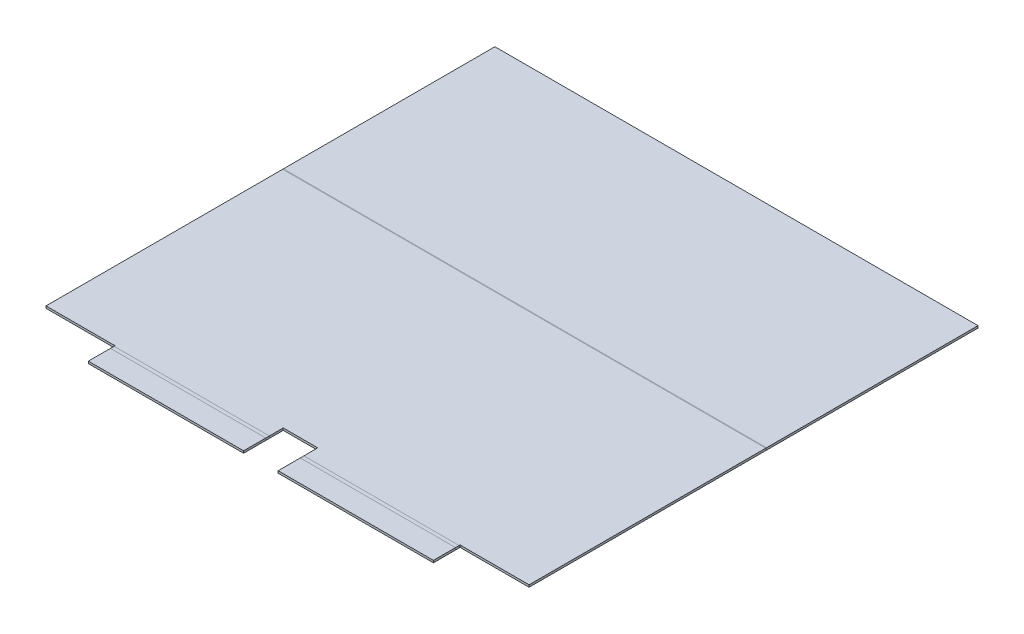
ISO-10303-21;
HEADER;
FILE_DESCRIPTION(('STEP AP214'),'2;1');
FILE_NAME('part.step','',(''),(''),'','','');
FILE_SCHEMA(('AUTOMOTIVE_DESIGN { 1 0 10303 214 1 1 1 1 }'));
ENDSEC;
DATA;
#1=APPLICATION_CONTEXT('core data for automotive mechanical design processes');
#2=APPLICATION_PROTOCOL_DEFINITION('international standard','automotive_design',2000,#1);
#3=PRODUCT_CONTEXT('',#1,'mechanical');
#4=PRODUCT('Part','Part','',(#3));
#5=PRODUCT_RELATED_PRODUCT_CATEGORY('part','',(#4));
#6=PRODUCT_DEFINITION_FORMATION('','',#4);
#7=PRODUCT_DEFINITION_CONTEXT('part definition',#1,'design');
#8=PRODUCT_DEFINITION('design','',#6,#7);
#9=PRODUCT_DEFINITION_SHAPE('','',#8);
#10=(LENGTH_UNIT() NAMED_UNIT(*) SI_UNIT(.MILLI.,.METRE.));
#11=(NAMED_UNIT(*) PLANE_ANGLE_UNIT() SI_UNIT($,.RADIAN.));
#12=(NAMED_UNIT(*) SI_UNIT($,.STERADIAN.) SOLID_ANGLE_UNIT());
#13=UNCERTAINTY_MEASURE_WITH_UNIT(LENGTH_MEASURE(1.E-05),#10,'distance_accuracy_value','');
#14=(GEOMETRIC_REPRESENTATION_CONTEXT(3) GLOBAL_UNCERTAINTY_ASSIGNED_CONTEXT((#13)) GLOBAL_UNIT_ASSIGNED_CONTEXT((#10,
#11,#12)) REPRESENTATION_CONTEXT('',''));
#15=CARTESIAN_POINT('',(0.,0.,0.));
#16=DIRECTION('',(0.,0.,1.));
#17=DIRECTION('',(1.,0.,0.));
#18=AXIS2_PLACEMENT_3D('',#15,#16,#17);
#19=CARTESIAN_POINT('',(0.,1.58749999999895,5.31041367340421));
#20=DIRECTION('',(0.,1.,0.));
#21=DIRECTION('',(0.,0.,1.));
#22=AXIS2_PLACEMENT_3D('',#19,#20,#21);
#23=PLANE('',#22);
#24=DIRECTION('',(0.,0.,-1.));
#25=VECTOR('',#24,1.);
#26=CARTESIAN_POINT('',(190.5,1.58750000000119,333.622969449045));
#27=LINE('',#26,#25);
#28=CARTESIAN_POINT('',(190.5,1.58750000000119,331.133134006371));
#29=VERTEX_POINT('',#28);
#30=CARTESIAN_POINT('',(190.5,1.58750000000112,320.922969449045));
#31=VERTEX_POINT('',#30);
#32=EDGE_CURVE('E458',#29,#31,#27,.T.);
#33=ORIENTED_EDGE('',*,*,#32,.F.);
#34=DIRECTION('',(1.,0.,0.));
#35=VECTOR('',#34,1.);
#36=CARTESIAN_POINT('',(190.5,1.58750000000119,331.133134006371));
#37=LINE('',#36,#35);
#38=CARTESIAN_POINT('',(304.8,1.58750000000119,331.133134006371));
#39=VERTEX_POINT('',#38);
#40=EDGE_CURVE('E533',#29,#39,#37,.T.);
#41=ORIENTED_EDGE('',*,*,#40,.T.);
#42=DIRECTION('',(0.,0.,1.));
#43=VECTOR('',#42,1.);
#44=CARTESIAN_POINT('',(304.8,1.58750000000123,333.622969449045));
#45=LINE('',#44,#43);
#46=CARTESIAN_POINT('',(304.8,1.58750000000119,330.339384006371));
#47=VERTEX_POINT('',#46);
#48=EDGE_CURVE('E485',#47,#39,#45,.T.);
#49=ORIENTED_EDGE('',*,*,#48,.F.);
#50=DIRECTION('',(1.,0.,0.));
#51=VECTOR('',#50,1.);
#52=CARTESIAN_POINT('',(0.,1.58750000000121,330.339384006371));
#53=LINE('',#52,#51);
#54=CARTESIAN_POINT('',(305.59375,1.58750000000119,330.339384006371));
#55=VERTEX_POINT('',#54);
#56=EDGE_CURVE('E435',#47,#55,#53,.T.);
#57=ORIENTED_EDGE('',*,*,#56,.T.);
#58=DIRECTION('',(0.,0.,1.));
#59=VECTOR('',#58,1.);
#60=CARTESIAN_POINT('',(305.59375,1.58749999999895,5.31041367340421));
#61=LINE('',#60,#59);
#62=CARTESIAN_POINT('',(305.59375,1.58750000000121,330.447969449045));
#63=VERTEX_POINT('',#62);
#64=EDGE_CURVE('E425',#55,#63,#61,.T.);
#65=ORIENTED_EDGE('',*,*,#64,.T.);
#66=DIRECTION('',(-1.,0.,0.));
#67=VECTOR('',#66,1.);
#68=CARTESIAN_POINT('',(355.6,1.58750000000121,330.447969449045));
#69=LINE('',#68,#67);
#70=CARTESIAN_POINT('',(355.6,1.58750000000121,330.447969449045));
#71=VERTEX_POINT('',#70);
#72=EDGE_CURVE('E473',#71,#63,#69,.T.);
#73=ORIENTED_EDGE('',*,*,#72,.F.);
#74=DIRECTION('',(0.,0.,1.));
#75=VECTOR('',#74,1.);
#76=CARTESIAN_POINT('',(355.6,1.58750000000121,333.622969449044));
#77=LINE('',#76,#75);
#78=CARTESIAN_POINT('',(355.6,1.58749999999999,156.232770984909));
#79=VERTEX_POINT('',#78);
#80=EDGE_CURVE('E497',#79,#71,#77,.T.);
#81=ORIENTED_EDGE('',*,*,#80,.F.);
#82=DIRECTION('',(-1.,0.,0.));
#83=VECTOR('',#82,1.);
#84=CARTESIAN_POINT('',(0.,1.58749999999998,156.232770984909));
#85=LINE('',#84,#83);
#86=CARTESIAN_POINT('',(0.,1.58749999999998,156.232770984909));
#87=VERTEX_POINT('',#86);
#88=EDGE_CURVE('E523',#79,#87,#85,.T.);
#89=ORIENTED_EDGE('',*,*,#88,.T.);
#90=DIRECTION('',(0.,0.,-1.));
#91=VECTOR('',#90,1.);
#92=CARTESIAN_POINT('',(0.,1.58749999999999,156.102888530919));
#93=LINE('',#92,#91);
#94=CARTESIAN_POINT('',(0.,1.58750000000121,330.447969449045));
#95=VERTEX_POINT('',#94);
#96=EDGE_CURVE('E494',#95,#87,#93,.T.);
#97=ORIENTED_EDGE('',*,*,#96,.F.);
#98=DIRECTION('',(-1.,0.,0.));
#99=VECTOR('',#98,1.);
#100=CARTESIAN_POINT('',(0.,1.58750000000121,330.447969449045));
#101=LINE('',#100,#99);
#102=CARTESIAN_POINT('',(50.00625,1.58750000000121,330.447969449045));
#103=VERTEX_POINT('',#102);
#104=EDGE_CURVE('E476',#103,#95,#101,.T.);
#105=ORIENTED_EDGE('',*,*,#104,.F.);
#106=DIRECTION('',(0.,0.,-1.));
#107=VECTOR('',#106,1.);
#108=CARTESIAN_POINT('',(50.00625,1.58749999999895,5.31041367340421));
#109=LINE('',#108,#107);
#110=CARTESIAN_POINT('',(50.00625,1.58750000000119,330.339384006371));
#111=VERTEX_POINT('',#110);
#112=EDGE_CURVE('E442',#103,#111,#109,.T.);
#113=ORIENTED_EDGE('',*,*,#112,.T.);
#114=DIRECTION('',(1.,0.,0.));
#115=VECTOR('',#114,1.);
#116=CARTESIAN_POINT('',(0.,1.58750000000119,330.339384006371));
#117=LINE('',#116,#115);
#118=CARTESIAN_POINT('',(50.8,1.58750000000119,330.339384006371));
#119=VERTEX_POINT('',#118);
#120=EDGE_CURVE('E452',#111,#119,#117,.T.);
#121=ORIENTED_EDGE('',*,*,#120,.T.);
#122=DIRECTION('',(0.,0.,-1.));
#123=VECTOR('',#122,1.);
#124=CARTESIAN_POINT('',(50.8,1.58750000000123,333.622969449045));
#125=LINE('',#124,#123);
#126=CARTESIAN_POINT('',(50.8,1.58750000000122,331.133134006371));
#127=VERTEX_POINT('',#126);
#128=EDGE_CURVE('E474',#127,#119,#125,.T.);
#129=ORIENTED_EDGE('',*,*,#128,.F.);
#130=DIRECTION('',(1.,0.,0.));
#131=VECTOR('',#130,1.);
#132=CARTESIAN_POINT('',(50.8,1.58750000000122,331.133134006371));
#133=LINE('',#132,#131);
#134=CARTESIAN_POINT('',(165.1,1.58750000000123,331.133134006371));
#135=VERTEX_POINT('',#134);
#136=EDGE_CURVE('E107',#127,#135,#133,.T.);
#137=ORIENTED_EDGE('',*,*,#136,.T.);
#138=DIRECTION('',(0.,0.,1.));
#139=VECTOR('',#138,1.);
#140=CARTESIAN_POINT('',(165.1,1.58750000000119,333.622969449045));
#141=LINE('',#140,#139);
#142=CARTESIAN_POINT('',(165.1,1.58750000000112,320.922969449045));
#143=VERTEX_POINT('',#142);
#144=EDGE_CURVE('E455',#143,#135,#141,.T.);
#145=ORIENTED_EDGE('',*,*,#144,.F.);
#146=DIRECTION('',(-1.,0.,0.));
#147=VECTOR('',#146,1.);
#148=CARTESIAN_POINT('',(165.1,1.58750000000112,320.922969449045));
#149=LINE('',#148,#147);
#150=EDGE_CURVE('E460',#31,#143,#149,.T.);
#151=ORIENTED_EDGE('',*,*,#150,.F.);
#152=EDGE_LOOP('',(#33,#41,#49,#57,#65,#73,#81,#89,#97,#105,#113,#121,#129,#137,#145,#151));
#153=FACE_BOUND('',#152,.T.);
#154=ADVANCED_FACE('F99',(#153),#23,.T.);
#155=CARTESIAN_POINT('',(0.,-1.0547118733939E-12,5.31041367340422));
#156=DIRECTION('',(0.,1.,0.));
#157=DIRECTION('',(0.,0.,1.));
#158=AXIS2_PLACEMENT_3D('',#155,#156,#157);
#159=PLANE('',#158);
#160=DIRECTION('',(1.,0.,0.));
#161=VECTOR('',#160,1.);
#162=CARTESIAN_POINT('',(190.5,1.19348975147204E-12,331.133134006371));
#163=LINE('',#162,#161);
#164=CARTESIAN_POINT('',(190.5,1.19399607209385E-12,331.133134006371));
#165=VERTEX_POINT('',#164);
#166=CARTESIAN_POINT('',(304.8,1.19348975147204E-12,331.133134006371));
#167=VERTEX_POINT('',#166);
#168=EDGE_CURVE('E529',#165,#167,#163,.T.);
#169=ORIENTED_EDGE('',*,*,#168,.F.);
#170=DIRECTION('',(0.,0.,-1.));
#171=VECTOR('',#170,1.);
#172=CARTESIAN_POINT('',(190.500000000001,-1.0547118733939E-12,5.31041367340464));
#173=LINE('',#172,#171);
#174=CARTESIAN_POINT('',(190.5,1.13103970633688E-12,320.922969449045));
#175=VERTEX_POINT('',#174);
#176=EDGE_CURVE('E466',#165,#175,#173,.T.);
#177=ORIENTED_EDGE('',*,*,#176,.T.);
#178=DIRECTION('',(-1.,0.,0.));
#179=VECTOR('',#178,1.);
#180=CARTESIAN_POINT('',(0.,1.13103970633688E-12,320.922969449045));
#181=LINE('',#180,#179);
#182=CARTESIAN_POINT('',(165.1,1.13103970633688E-12,320.922969449045));
#183=VERTEX_POINT('',#182);
#184=EDGE_CURVE('E509',#175,#183,#181,.T.);
#185=ORIENTED_EDGE('',*,*,#184,.T.);
#186=DIRECTION('',(0.,0.,1.));
#187=VECTOR('',#186,1.);
#188=CARTESIAN_POINT('',(165.1,-1.0547118733939E-12,5.31041367340422));
#189=LINE('',#188,#187);
#190=CARTESIAN_POINT('',(165.1,1.22818422099158E-12,331.133134006371));
#191=VERTEX_POINT('',#190);
#192=EDGE_CURVE('E470',#183,#191,#189,.T.);
#193=ORIENTED_EDGE('',*,*,#192,.T.);
#194=DIRECTION('',(1.,0.,0.));
#195=VECTOR('',#194,1.);
#196=CARTESIAN_POINT('',(50.8,1.22818422099158E-12,331.133134006371));
#197=LINE('',#196,#195);
#198=CARTESIAN_POINT('',(50.8,1.22869054161338E-12,331.133134006371));
#199=VERTEX_POINT('',#198);
#200=EDGE_CURVE('E539',#199,#191,#197,.T.);
#201=ORIENTED_EDGE('',*,*,#200,.F.);
#202=DIRECTION('',(0.,0.,-1.));
#203=VECTOR('',#202,1.);
#204=CARTESIAN_POINT('',(50.8,-1.0547118733939E-12,5.31041367340422));
#205=LINE('',#204,#203);
#206=CARTESIAN_POINT('',(50.8,1.20042864537595E-12,330.339384006371));
#207=VERTEX_POINT('',#206);
#208=EDGE_CURVE('E491',#199,#207,#205,.T.);
#209=ORIENTED_EDGE('',*,*,#208,.T.);
#210=DIRECTION('',(1.,0.,0.));
#211=VECTOR('',#210,1.);
#212=CARTESIAN_POINT('',(50.00625,1.22124532708767E-12,330.339384006371));
#213=LINE('',#212,#211);
#214=CARTESIAN_POINT('',(50.00625,1.20042864537595E-12,330.339384006371));
#215=VERTEX_POINT('',#214);
#216=EDGE_CURVE('E443',#215,#207,#213,.T.);
#217=ORIENTED_EDGE('',*,*,#216,.F.);
#218=DIRECTION('',(0.,0.,-1.));
#219=VECTOR('',#218,1.);
#220=CARTESIAN_POINT('',(50.00625,1.23512311489549E-12,333.622969449045));
#221=LINE('',#220,#219);
#222=CARTESIAN_POINT('',(50.00625,1.19348975147204E-12,330.447969449045));
#223=VERTEX_POINT('',#222);
#224=EDGE_CURVE('E439',#223,#215,#221,.T.);
#225=ORIENTED_EDGE('',*,*,#224,.F.);
#226=DIRECTION('',(-1.,0.,0.));
#227=VECTOR('',#226,1.);
#228=CARTESIAN_POINT('',(0.,1.19348975147204E-12,330.447969449045));
#229=LINE('',#228,#227);
#230=CARTESIAN_POINT('',(0.,1.19348975147204E-12,330.447969449045));
#231=VERTEX_POINT('',#230);
#232=EDGE_CURVE('E507',#223,#231,#229,.T.);
#233=ORIENTED_EDGE('',*,*,#232,.T.);
#234=DIRECTION('',(0.,0.,1.));
#235=VECTOR('',#234,1.);
#236=CARTESIAN_POINT('',(0.,-1.0547118733939E-12,5.31041367340422));
#237=LINE('',#236,#235);
#238=CARTESIAN_POINT('',(0.,0.,156.232770984909));
#239=VERTEX_POINT('',#238);
#240=EDGE_CURVE('E500',#231,#239,#237,.F.);
#241=ORIENTED_EDGE('',*,*,#240,.T.);
#242=DIRECTION('',(-1.,0.,0.));
#243=VECTOR('',#242,1.);
#244=CARTESIAN_POINT('',(355.6,0.,156.232770984909));
#245=LINE('',#244,#243);
#246=CARTESIAN_POINT('',(355.6,0.,156.232770984909));
#247=VERTEX_POINT('',#246);
#248=EDGE_CURVE('E517',#247,#239,#245,.T.);
#249=ORIENTED_EDGE('',*,*,#248,.F.);
#250=DIRECTION('',(0.,0.,-1.));
#251=VECTOR('',#250,1.);
#252=CARTESIAN_POINT('',(355.6,-1.0547118733939E-12,5.31041367340421));
#253=LINE('',#252,#251);
#254=CARTESIAN_POINT('',(355.6,1.19348975147204E-12,330.447969449045));
#255=VERTEX_POINT('',#254);
#256=EDGE_CURVE('E493',#247,#255,#253,.F.);
#257=ORIENTED_EDGE('',*,*,#256,.T.);
#258=DIRECTION('',(-1.,0.,0.));
#259=VECTOR('',#258,1.);
#260=CARTESIAN_POINT('',(0.,1.19348975147204E-12,330.447969449045));
#261=LINE('',#260,#259);
#262=CARTESIAN_POINT('',(305.59375,1.22124532708767E-12,330.447969449045));
#263=VERTEX_POINT('',#262);
#264=EDGE_CURVE('E496',#255,#263,#261,.T.);
#265=ORIENTED_EDGE('',*,*,#264,.T.);
#266=DIRECTION('',(0.,0.,1.));
#267=VECTOR('',#266,1.);
#268=CARTESIAN_POINT('',(305.59375,1.18655085756814E-12,330.339384006371));
#269=LINE('',#268,#267);
#270=CARTESIAN_POINT('',(305.59375,1.18655085756814E-12,330.339384006371));
#271=VERTEX_POINT('',#270);
#272=EDGE_CURVE('E427',#271,#263,#269,.T.);
#273=ORIENTED_EDGE('',*,*,#272,.F.);
#274=DIRECTION('',(1.,0.,0.));
#275=VECTOR('',#274,1.);
#276=CARTESIAN_POINT('',(304.8,1.18655085756814E-12,330.339384006371));
#277=LINE('',#276,#275);
#278=CARTESIAN_POINT('',(304.8,1.18655085756814E-12,330.339384006371));
#279=VERTEX_POINT('',#278);
#280=EDGE_CURVE('E422',#279,#271,#277,.T.);
#281=ORIENTED_EDGE('',*,*,#280,.F.);
#282=DIRECTION('',(0.,0.,1.));
#283=VECTOR('',#282,1.);
#284=CARTESIAN_POINT('',(304.8,-1.0547118733939E-12,5.31041367340421));
#285=LINE('',#284,#283);
#286=EDGE_CURVE('E482',#279,#167,#285,.T.);
#287=ORIENTED_EDGE('',*,*,#286,.T.);
#288=EDGE_LOOP('',(#169,#177,#185,#193,#201,#209,#217,#225,#233,#241,#249,#257,#265,#273,#281,#287));
#289=FACE_BOUND('',#288,.T.);
#290=ADVANCED_FACE('F605',(#289),#159,.F.);
#291=CARTESIAN_POINT('',(355.6,-110.350326641829,330.447969449045));
#292=DIRECTION('',(0.,0.,-1.));
#293=DIRECTION('',(0.,1.,0.));
#294=AXIS2_PLACEMENT_3D('',#291,#292,#293);
#295=PLANE('',#294);
#296=DIRECTION('',(0.,1.,0.));
#297=VECTOR('',#296,1.);
#298=CARTESIAN_POINT('',(305.59375,-110.350326641829,330.447969449045));
#299=LINE('',#298,#297);
#300=EDGE_CURVE('E515',#263,#63,#299,.T.);
#301=ORIENTED_EDGE('',*,*,#300,.F.);
#302=ORIENTED_EDGE('',*,*,#264,.F.);
#303=DIRECTION('',(0.,1.,0.));
#304=VECTOR('',#303,1.);
#305=CARTESIAN_POINT('',(355.6,-110.350326641829,330.447969449045));
#306=LINE('',#305,#304);
#307=EDGE_CURVE('E477',#255,#71,#306,.T.);
#308=ORIENTED_EDGE('',*,*,#307,.T.);
#309=ORIENTED_EDGE('',*,*,#72,.T.);
#310=EDGE_LOOP('',(#301,#302,#308,#309));
#311=FACE_BOUND('',#310,.T.);
#312=ADVANCED_FACE('F599',(#311),#295,.F.);
#313=CARTESIAN_POINT('',(304.8,-110.350326641829,333.622969449045));
#314=DIRECTION('',(-1.,0.,0.));
#315=DIRECTION('',(0.,0.34202014332567,0.939692620785908));
#316=AXIS2_PLACEMENT_3D('',#313,#314,#315);
#317=PLANE('',#316);
#318=DIRECTION('',(0.,1.,0.));
#319=VECTOR('',#318,1.);
#320=CARTESIAN_POINT('',(304.8,1.19348975147204E-12,331.133134006371));
#321=LINE('',#320,#319);
#322=EDGE_CURVE('E531',#167,#39,#321,.T.);
#323=ORIENTED_EDGE('',*,*,#322,.F.);
#324=ORIENTED_EDGE('',*,*,#286,.F.);
#325=DIRECTION('',(0.,1.,0.));
#326=VECTOR('',#325,1.);
#327=CARTESIAN_POINT('',(304.8,1.18655085756814E-12,330.339384006371));
#328=LINE('',#327,#326);
#329=EDGE_CURVE('E426',#279,#47,#328,.T.);
#330=ORIENTED_EDGE('',*,*,#329,.T.);
#331=ORIENTED_EDGE('',*,*,#48,.T.);
#332=EDGE_LOOP('',(#323,#324,#330,#331));
#333=FACE_BOUND('',#332,.T.);
#334=ADVANCED_FACE('F587',(#333),#317,.F.);
#335=CARTESIAN_POINT('',(190.5,-110.350326641829,333.622969449045));
#336=DIRECTION('',(1.,0.,0.));
#337=DIRECTION('',(0.,-0.34202014332567,-0.939692620785908));
#338=AXIS2_PLACEMENT_3D('',#335,#336,#337);
#339=PLANE('',#338);
#340=DIRECTION('',(0.,1.,0.));
#341=VECTOR('',#340,1.);
#342=CARTESIAN_POINT('',(190.5,1.19348975147204E-12,331.133134006371));
#343=LINE('',#342,#341);
#344=EDGE_CURVE('E536',#165,#29,#343,.T.);
#345=ORIENTED_EDGE('',*,*,#344,.T.);
#346=ORIENTED_EDGE('',*,*,#32,.T.);
#347=DIRECTION('',(0.,1.,0.));
#348=VECTOR('',#347,1.);
#349=CARTESIAN_POINT('',(190.5,-110.350326641829,320.922969449046));
#350=LINE('',#349,#348);
#351=EDGE_CURVE('E463',#175,#31,#350,.T.);
#352=ORIENTED_EDGE('',*,*,#351,.F.);
#353=ORIENTED_EDGE('',*,*,#176,.F.);
#354=EDGE_LOOP('',(#345,#346,#352,#353));
#355=FACE_BOUND('',#354,.T.);
#356=ADVANCED_FACE('F563',(#355),#339,.F.);
#357=CARTESIAN_POINT('',(0.,-110.350326641829,330.447969449045));
#358=DIRECTION('',(0.,0.,-1.));
#359=DIRECTION('',(0.,1.,0.));
#360=AXIS2_PLACEMENT_3D('',#357,#358,#359);
#361=PLANE('',#360);
#362=DIRECTION('',(0.,-1.,0.));
#363=VECTOR('',#362,1.);
#364=CARTESIAN_POINT('',(50.00625,-110.350326641829,330.447969449045));
#365=LINE('',#364,#363);
#366=EDGE_CURVE('E512',#103,#223,#365,.T.);
#367=ORIENTED_EDGE('',*,*,#366,.F.);
#368=ORIENTED_EDGE('',*,*,#104,.T.);
#369=DIRECTION('',(0.,1.,0.));
#370=VECTOR('',#369,1.);
#371=CARTESIAN_POINT('',(0.,-110.350326641829,330.447969449045));
#372=LINE('',#371,#370);
#373=EDGE_CURVE('E479',#231,#95,#372,.T.);
#374=ORIENTED_EDGE('',*,*,#373,.F.);
#375=ORIENTED_EDGE('',*,*,#232,.F.);
#376=EDGE_LOOP('',(#367,#368,#374,#375));
#377=FACE_BOUND('',#376,.T.);
#378=ADVANCED_FACE('F639',(#377),#361,.F.);
#379=CARTESIAN_POINT('',(50.8,-110.350326641829,333.622969449045));
#380=DIRECTION('',(1.,0.,0.));
#381=DIRECTION('',(0.,-0.34202014332567,-0.939692620785908));
#382=AXIS2_PLACEMENT_3D('',#379,#380,#381);
#383=PLANE('',#382);
#384=DIRECTION('',(0.,1.,0.));
#385=VECTOR('',#384,1.);
#386=CARTESIAN_POINT('',(50.8,1.22818422099158E-12,331.133134006371));
#387=LINE('',#386,#385);
#388=EDGE_CURVE('E13',#199,#127,#387,.T.);
#389=ORIENTED_EDGE('',*,*,#388,.T.);
#390=ORIENTED_EDGE('',*,*,#128,.T.);
#391=DIRECTION('',(0.,1.,0.));
#392=VECTOR('',#391,1.);
#393=CARTESIAN_POINT('',(50.8,1.22124532708767E-12,330.339384006371));
#394=LINE('',#393,#392);
#395=EDGE_CURVE('E438',#207,#119,#394,.T.);
#396=ORIENTED_EDGE('',*,*,#395,.F.);
#397=ORIENTED_EDGE('',*,*,#208,.F.);
#398=EDGE_LOOP('',(#389,#390,#396,#397));
#399=FACE_BOUND('',#398,.T.);
#400=ADVANCED_FACE('F649',(#399),#383,.F.);
#401=CARTESIAN_POINT('',(165.1,-110.350326641829,333.622969449045));
#402=DIRECTION('',(-1.,0.,0.));
#403=DIRECTION('',(0.,0.34202014332567,0.939692620785908));
#404=AXIS2_PLACEMENT_3D('',#401,#402,#403);
#405=PLANE('',#404);
#406=DIRECTION('',(0.,1.,0.));
#407=VECTOR('',#406,1.);
#408=CARTESIAN_POINT('',(165.1,1.22818422099158E-12,331.133134006371));
#409=LINE('',#408,#407);
#410=EDGE_CURVE('E541',#191,#135,#409,.T.);
#411=ORIENTED_EDGE('',*,*,#410,.F.);
#412=ORIENTED_EDGE('',*,*,#192,.F.);
#413=DIRECTION('',(0.,1.,0.));
#414=VECTOR('',#413,1.);
#415=CARTESIAN_POINT('',(165.1,-110.350326641829,320.922969449046));
#416=LINE('',#415,#414);
#417=EDGE_CURVE('E464',#183,#143,#416,.T.);
#418=ORIENTED_EDGE('',*,*,#417,.T.);
#419=ORIENTED_EDGE('',*,*,#144,.T.);
#420=EDGE_LOOP('',(#411,#412,#418,#419));
#421=FACE_BOUND('',#420,.T.);
#422=ADVANCED_FACE('F555',(#421),#405,.F.);
#423=CARTESIAN_POINT('',(0.,1.58749999999998,156.102888530919));
#424=DIRECTION('',(-1.,0.,0.));
#425=DIRECTION('',(0.,0.34202014332567,0.939692620785908));
#426=AXIS2_PLACEMENT_3D('',#423,#424,#425);
#427=PLANE('',#426);
#428=ORIENTED_EDGE('',*,*,#373,.T.);
#429=ORIENTED_EDGE('',*,*,#96,.T.);
#430=DIRECTION('',(0.,1.,0.));
#431=VECTOR('',#430,1.);
#432=CARTESIAN_POINT('',(0.,0.,156.232770984909));
#433=LINE('',#432,#431);
#434=EDGE_CURVE('E520',#239,#87,#433,.T.);
#435=ORIENTED_EDGE('',*,*,#434,.F.);
#436=ORIENTED_EDGE('',*,*,#240,.F.);
#437=EDGE_LOOP('',(#428,#429,#435,#436));
#438=FACE_BOUND('',#437,.T.);
#439=ADVANCED_FACE('F635',(#438),#427,.T.);
#440=CARTESIAN_POINT('',(355.6,1.58750000000121,333.622969449044));
#441=DIRECTION('',(1.,0.,0.));
#442=DIRECTION('',(0.,-0.34202014332567,-0.939692620785908));
#443=AXIS2_PLACEMENT_3D('',#440,#441,#442);
#444=PLANE('',#443);
#445=ORIENTED_EDGE('',*,*,#307,.F.);
#446=ORIENTED_EDGE('',*,*,#256,.F.);
#447=DIRECTION('',(0.,1.,0.));
#448=VECTOR('',#447,1.);
#449=CARTESIAN_POINT('',(355.6,1.58749999999998,156.232770984909));
#450=LINE('',#449,#448);
#451=EDGE_CURVE('E526',#247,#79,#450,.T.);
#452=ORIENTED_EDGE('',*,*,#451,.T.);
#453=ORIENTED_EDGE('',*,*,#80,.T.);
#454=EDGE_LOOP('',(#445,#446,#452,#453));
#455=FACE_BOUND('',#454,.T.);
#456=ADVANCED_FACE('F101',(#455),#444,.T.);
#457=CARTESIAN_POINT('',(165.1,-110.350326641829,320.922969449046));
#458=DIRECTION('',(0.,0.,-1.));
#459=DIRECTION('',(0.,1.,0.));
#460=AXIS2_PLACEMENT_3D('',#457,#458,#459);
#461=PLANE('',#460);
#462=ORIENTED_EDGE('',*,*,#351,.T.);
#463=ORIENTED_EDGE('',*,*,#150,.T.);
#464=ORIENTED_EDGE('',*,*,#417,.F.);
#465=ORIENTED_EDGE('',*,*,#184,.F.);
#466=EDGE_LOOP('',(#462,#463,#464,#465));
#467=FACE_BOUND('',#466,.T.);
#468=ADVANCED_FACE('F559',(#467),#461,.F.);
#469=CARTESIAN_POINT('',(50.00625,1.23512311489549E-12,333.622969449045));
#470=DIRECTION('',(1.,0.,0.));
#471=DIRECTION('',(0.,-0.34202014332567,-0.939692620785908));
#472=AXIS2_PLACEMENT_3D('',#469,#470,#471);
#473=PLANE('',#472);
#474=ORIENTED_EDGE('',*,*,#112,.F.);
#475=ORIENTED_EDGE('',*,*,#366,.T.);
#476=ORIENTED_EDGE('',*,*,#224,.T.);
#477=DIRECTION('',(0.,1.,0.));
#478=VECTOR('',#477,1.);
#479=CARTESIAN_POINT('',(50.00625,1.22124532708767E-12,330.339384006371));
#480=LINE('',#479,#478);
#481=EDGE_CURVE('E446',#215,#111,#480,.T.);
#482=ORIENTED_EDGE('',*,*,#481,.T.);
#483=EDGE_LOOP('',(#474,#475,#476,#482));
#484=FACE_BOUND('',#483,.T.);
#485=ADVANCED_FACE('F641',(#484),#473,.T.);
#486=CARTESIAN_POINT('',(50.00625,1.22124532708767E-12,330.339384006371));
#487=DIRECTION('',(0.,0.,1.));
#488=DIRECTION('',(0.,-1.,0.));
#489=AXIS2_PLACEMENT_3D('',#486,#487,#488);
#490=PLANE('',#489);
#491=ORIENTED_EDGE('',*,*,#120,.F.);
#492=ORIENTED_EDGE('',*,*,#481,.F.);
#493=ORIENTED_EDGE('',*,*,#216,.T.);
#494=ORIENTED_EDGE('',*,*,#395,.T.);
#495=EDGE_LOOP('',(#491,#492,#493,#494));
#496=FACE_BOUND('',#495,.T.);
#497=ADVANCED_FACE('F645',(#496),#490,.T.);
#498=CARTESIAN_POINT('',(304.8,1.18655085756814E-12,330.339384006371));
#499=DIRECTION('',(0.,0.,1.));
#500=DIRECTION('',(0.,-1.,0.));
#501=AXIS2_PLACEMENT_3D('',#498,#499,#500);
#502=PLANE('',#501);
#503=ORIENTED_EDGE('',*,*,#56,.F.);
#504=ORIENTED_EDGE('',*,*,#329,.F.);
#505=ORIENTED_EDGE('',*,*,#280,.T.);
#506=DIRECTION('',(0.,1.,0.));
#507=VECTOR('',#506,1.);
#508=CARTESIAN_POINT('',(305.59375,1.18655085756814E-12,330.339384006371));
#509=LINE('',#508,#507);
#510=EDGE_CURVE('E393',#271,#55,#509,.T.);
#511=ORIENTED_EDGE('',*,*,#510,.T.);
#512=EDGE_LOOP('',(#503,#504,#505,#511));
#513=FACE_BOUND('',#512,.T.);
#514=ADVANCED_FACE('F591',(#513),#502,.T.);
#515=CARTESIAN_POINT('',(305.59375,1.18655085756814E-12,330.339384006371));
#516=DIRECTION('',(-1.,0.,0.));
#517=DIRECTION('',(0.,0.34202014332567,0.939692620785908));
#518=AXIS2_PLACEMENT_3D('',#515,#516,#517);
#519=PLANE('',#518);
#520=ORIENTED_EDGE('',*,*,#64,.F.);
#521=ORIENTED_EDGE('',*,*,#510,.F.);
#522=ORIENTED_EDGE('',*,*,#272,.T.);
#523=ORIENTED_EDGE('',*,*,#300,.T.);
#524=EDGE_LOOP('',(#520,#521,#522,#523));
#525=FACE_BOUND('',#524,.T.);
#526=ADVANCED_FACE('F595',(#525),#519,.T.);
#527=CARTESIAN_POINT('',(355.6,1.5875,0.));
#528=DIRECTION('',(0.,0.,-1.));
#529=DIRECTION('',(0.,1.,0.));
#530=AXIS2_PLACEMENT_3D('',#527,#528,#529);
#531=PLANE('',#530);
#532=DIRECTION('',(0.,-1.,0.));
#533=VECTOR('',#532,1.);
#534=CARTESIAN_POINT('',(0.,1.5875,0.));
#535=LINE('',#534,#533);
#536=CARTESIAN_POINT('',(0.,1.5875,0.));
#537=VERTEX_POINT('',#536);
#538=CARTESIAN_POINT('',(0.,0.,0.));
#539=VERTEX_POINT('',#538);
#540=EDGE_CURVE('E402',#537,#539,#535,.T.);
#541=ORIENTED_EDGE('',*,*,#540,.F.);
#542=DIRECTION('',(-1.,0.,0.));
#543=VECTOR('',#542,1.);
#544=CARTESIAN_POINT('',(355.6,1.5875,0.));
#545=LINE('',#544,#543);
#546=CARTESIAN_POINT('',(355.6,1.5875,0.));
#547=VERTEX_POINT('',#546);
#548=EDGE_CURVE('E397',#547,#537,#545,.T.);
#549=ORIENTED_EDGE('',*,*,#548,.F.);
#550=DIRECTION('',(0.,-1.,0.));
#551=VECTOR('',#550,1.);
#552=CARTESIAN_POINT('',(355.6,1.5875,0.));
#553=LINE('',#552,#551);
#554=CARTESIAN_POINT('',(355.6,0.,0.));
#555=VERTEX_POINT('',#554);
#556=EDGE_CURVE('E416',#547,#555,#553,.T.);
#557=ORIENTED_EDGE('',*,*,#556,.T.);
#558=DIRECTION('',(-1.,0.,0.));
#559=VECTOR('',#558,1.);
#560=CARTESIAN_POINT('',(355.6,0.,0.));
#561=LINE('',#560,#559);
#562=EDGE_CURVE('E414',#555,#539,#561,.T.);
#563=ORIENTED_EDGE('',*,*,#562,.T.);
#564=EDGE_LOOP('',(#541,#549,#557,#563));
#565=FACE_BOUND('',#564,.T.);
#566=ADVANCED_FACE('F776',(#565),#531,.T.);
#567=CARTESIAN_POINT('',(355.6,0.,0.));
#568=DIRECTION('',(0.,-1.,0.));
#569=DIRECTION('',(0.,0.,-1.));
#570=AXIS2_PLACEMENT_3D('',#567,#568,#569);
#571=PLANE('',#570);
#572=DIRECTION('',(0.,0.,1.));
#573=VECTOR('',#572,1.);
#574=CARTESIAN_POINT('',(355.6,0.,0.));
#575=LINE('',#574,#573);
#576=CARTESIAN_POINT('',(355.6,0.,155.698578060751));
#577=VERTEX_POINT('',#576);
#578=EDGE_CURVE('E411',#555,#577,#575,.T.);
#579=ORIENTED_EDGE('',*,*,#578,.T.);
#580=DIRECTION('',(1.,0.,0.));
#581=VECTOR('',#580,1.);
#582=CARTESIAN_POINT('',(0.,0.,155.698578060751));
#583=LINE('',#582,#581);
#584=CARTESIAN_POINT('',(0.,0.,155.698578060751));
#585=VERTEX_POINT('',#584);
#586=EDGE_CURVE('E386',#585,#577,#583,.T.);
#587=ORIENTED_EDGE('',*,*,#586,.F.);
#588=DIRECTION('',(0.,0.,1.));
#589=VECTOR('',#588,1.);
#590=CARTESIAN_POINT('',(0.,0.,0.));
#591=LINE('',#590,#589);
#592=EDGE_CURVE('E408',#539,#585,#591,.T.);
#593=ORIENTED_EDGE('',*,*,#592,.F.);
#594=ORIENTED_EDGE('',*,*,#562,.F.);
#595=EDGE_LOOP('',(#579,#587,#593,#594));
#596=FACE_BOUND('',#595,.T.);
#597=ADVANCED_FACE('F622',(#596),#571,.T.);
#598=CARTESIAN_POINT('',(0.,0.,0.));
#599=DIRECTION('',(-1.,0.,0.));
#600=DIRECTION('',(0.,0.,1.));
#601=AXIS2_PLACEMENT_3D('',#598,#599,#600);
#602=PLANE('',#601);
#603=ORIENTED_EDGE('',*,*,#592,.T.);
#604=DIRECTION('',(0.,1.,0.));
#605=VECTOR('',#604,1.);
#606=CARTESIAN_POINT('',(0.,0.,155.698578060751));
#607=LINE('',#606,#605);
#608=CARTESIAN_POINT('',(0.,1.58750000000001,155.698578060751));
#609=VERTEX_POINT('',#608);
#610=EDGE_CURVE('E405',#585,#609,#607,.T.);
#611=ORIENTED_EDGE('',*,*,#610,.T.);
#612=DIRECTION('',(0.,0.,1.));
#613=VECTOR('',#612,1.);
#614=CARTESIAN_POINT('',(0.,1.5875,0.));
#615=LINE('',#614,#613);
#616=EDGE_CURVE('E394',#537,#609,#615,.T.);
#617=ORIENTED_EDGE('',*,*,#616,.F.);
#618=ORIENTED_EDGE('',*,*,#540,.T.);
#619=EDGE_LOOP('',(#603,#611,#617,#618));
#620=FACE_BOUND('',#619,.T.);
#621=ADVANCED_FACE('F618',(#620),#602,.T.);
#622=CARTESIAN_POINT('',(355.6,1.5875,0.));
#623=DIRECTION('',(0.,-1.,0.));
#624=DIRECTION('',(0.,0.,-1.));
#625=AXIS2_PLACEMENT_3D('',#622,#623,#624);
#626=PLANE('',#625);
#627=DIRECTION('',(1.,0.,0.));
#628=VECTOR('',#627,1.);
#629=CARTESIAN_POINT('',(0.,1.58750000000001,155.698578060751));
#630=LINE('',#629,#628);
#631=CARTESIAN_POINT('',(355.6,1.5875,155.698578060751));
#632=VERTEX_POINT('',#631);
#633=EDGE_CURVE('E399',#609,#632,#630,.T.);
#634=ORIENTED_EDGE('',*,*,#633,.T.);
#635=DIRECTION('',(0.,0.,1.));
#636=VECTOR('',#635,1.);
#637=CARTESIAN_POINT('',(355.6,1.5875,0.));
#638=LINE('',#637,#636);
#639=EDGE_CURVE('E390',#547,#632,#638,.T.);
#640=ORIENTED_EDGE('',*,*,#639,.F.);
#641=ORIENTED_EDGE('',*,*,#548,.T.);
#642=ORIENTED_EDGE('',*,*,#616,.T.);
#643=EDGE_LOOP('',(#634,#640,#641,#642));
#644=FACE_BOUND('',#643,.T.);
#645=ADVANCED_FACE('F802',(#644),#626,.F.);
#646=CARTESIAN_POINT('',(355.6,0.,0.));
#647=DIRECTION('',(-1.,0.,0.));
#648=DIRECTION('',(0.,0.,1.));
#649=AXIS2_PLACEMENT_3D('',#646,#647,#648);
#650=PLANE('',#649);
#651=DIRECTION('',(0.,1.,0.));
#652=VECTOR('',#651,1.);
#653=CARTESIAN_POINT('',(355.6,0.,155.698578060751));
#654=LINE('',#653,#652);
#655=EDGE_CURVE('E419',#577,#632,#654,.T.);
#656=ORIENTED_EDGE('',*,*,#655,.F.);
#657=ORIENTED_EDGE('',*,*,#578,.F.);
#658=ORIENTED_EDGE('',*,*,#556,.F.);
#659=ORIENTED_EDGE('',*,*,#639,.T.);
#660=EDGE_LOOP('',(#656,#657,#658,#659));
#661=FACE_BOUND('',#660,.T.);
#662=ADVANCED_FACE('F811',(#661),#650,.F.);
#663=CARTESIAN_POINT('',(355.6,0.,155.698578060751));
#664=DIRECTION('',(1.,0.,0.));
#665=DIRECTION('',(0.,0.,1.));
#666=AXIS2_PLACEMENT_3D('',#663,#664,#665);
#667=PLANE('',#666);
#668=ORIENTED_EDGE('',*,*,#655,.T.);
#669=DIRECTION('',(0.,0.,-1.));
#670=VECTOR('',#669,1.);
#671=CARTESIAN_POINT('',(355.6,1.5875,155.96567452283));
#672=LINE('',#671,#670);
#673=EDGE_CURVE('E375',#632,#79,#672,.F.);
#674=ORIENTED_EDGE('',*,*,#673,.T.);
#675=ORIENTED_EDGE('',*,*,#451,.F.);
#676=DIRECTION('',(0.,0.,1.));
#677=VECTOR('',#676,1.);
#678=CARTESIAN_POINT('',(355.6,0.,155.698578060751));
#679=LINE('',#678,#677);
#680=EDGE_CURVE('E379',#577,#247,#679,.T.);
#681=ORIENTED_EDGE('',*,*,#680,.F.);
#682=EDGE_LOOP('',(#668,#674,#675,#681));
#683=FACE_BOUND('',#682,.T.);
#684=ADVANCED_FACE('F626',(#683),#667,.T.);
#685=CARTESIAN_POINT('',(0.,0.,156.232770984909));
#686=DIRECTION('',(-1.,0.,0.));
#687=DIRECTION('',(0.,0.,-1.));
#688=AXIS2_PLACEMENT_3D('',#685,#686,#687);
#689=PLANE('',#688);
#690=DIRECTION('',(0.,0.,-1.));
#691=VECTOR('',#690,1.);
#692=CARTESIAN_POINT('',(0.,1.5875,155.96567452283));
#693=LINE('',#692,#691);
#694=EDGE_CURVE('E383',#87,#609,#693,.T.);
#695=ORIENTED_EDGE('',*,*,#694,.T.);
#696=ORIENTED_EDGE('',*,*,#610,.F.);
#697=DIRECTION('',(0.,0.,-1.));
#698=VECTOR('',#697,1.);
#699=CARTESIAN_POINT('',(0.,0.,156.232770984909));
#700=LINE('',#699,#698);
#701=EDGE_CURVE('E382',#239,#585,#700,.T.);
#702=ORIENTED_EDGE('',*,*,#701,.F.);
#703=ORIENTED_EDGE('',*,*,#434,.T.);
#704=EDGE_LOOP('',(#695,#696,#702,#703));
#705=FACE_BOUND('',#704,.T.);
#706=ADVANCED_FACE('F613',(#705),#689,.T.);
#707=CARTESIAN_POINT('',(177.8,0.,155.96567452283));
#708=DIRECTION('',(0.,-1.,0.));
#709=DIRECTION('',(0.,0.,-1.));
#710=AXIS2_PLACEMENT_3D('',#707,#708,#709);
#711=PLANE('',#710);
#712=ORIENTED_EDGE('',*,*,#248,.T.);
#713=ORIENTED_EDGE('',*,*,#701,.T.);
#714=ORIENTED_EDGE('',*,*,#586,.T.);
#715=ORIENTED_EDGE('',*,*,#680,.T.);
#716=EDGE_LOOP('',(#712,#713,#714,#715));
#717=FACE_BOUND('',#716,.T.);
#718=ADVANCED_FACE('F609',(#717),#711,.T.);
#719=CARTESIAN_POINT('',(177.8,1.5875,155.96567452283));
#720=DIRECTION('',(0.,-1.,0.));
#721=DIRECTION('',(0.,0.,-1.));
#722=AXIS2_PLACEMENT_3D('',#719,#720,#721);
#723=PLANE('',#722);
#724=ORIENTED_EDGE('',*,*,#88,.F.);
#725=ORIENTED_EDGE('',*,*,#673,.F.);
#726=ORIENTED_EDGE('',*,*,#633,.F.);
#727=ORIENTED_EDGE('',*,*,#694,.F.);
#728=EDGE_LOOP('',(#724,#725,#726,#727));
#729=FACE_BOUND('',#728,.T.);
#730=ADVANCED_FACE('F630',(#729),#723,.F.);
#731=CARTESIAN_POINT('',(304.8,1.19348975147204E-12,331.133134006371));
#732=DIRECTION('',(1.,0.,0.));
#733=DIRECTION('',(0.,0.,1.));
#734=AXIS2_PLACEMENT_3D('',#731,#732,#733);
#735=PLANE('',#734);
#736=ORIENTED_EDGE('',*,*,#322,.T.);
#737=DIRECTION('',(0.,0.,-1.));
#738=VECTOR('',#737,1.);
#739=CARTESIAN_POINT('',(304.8,1.5875000000012,332.468616316766));
#740=LINE('',#739,#738);
#741=CARTESIAN_POINT('',(304.8,1.58750000000119,333.804098627161));
#742=VERTEX_POINT('',#741);
#743=EDGE_CURVE('E340',#39,#742,#740,.F.);
#744=ORIENTED_EDGE('',*,*,#743,.T.);
#745=DIRECTION('',(0.,1.,0.));
#746=VECTOR('',#745,1.);
#747=CARTESIAN_POINT('',(304.8,1.58750000000119,333.804098627161));
#748=LINE('',#747,#746);
#749=CARTESIAN_POINT('',(304.8,1.22124532708767E-12,333.804098627161));
#750=VERTEX_POINT('',#749);
#751=EDGE_CURVE('E346',#750,#742,#748,.T.);
#752=ORIENTED_EDGE('',*,*,#751,.F.);
#753=DIRECTION('',(0.,0.,1.));
#754=VECTOR('',#753,1.);
#755=CARTESIAN_POINT('',(304.8,1.19348975147204E-12,331.133134006371));
#756=LINE('',#755,#754);
#757=EDGE_CURVE('E369',#167,#750,#756,.T.);
#758=ORIENTED_EDGE('',*,*,#757,.F.);
#759=EDGE_LOOP('',(#736,#744,#752,#758));
#760=FACE_BOUND('',#759,.T.);
#761=ADVANCED_FACE('F580',(#760),#735,.T.);
#762=CARTESIAN_POINT('',(190.5,1.2123813438976E-12,333.804098627161));
#763=DIRECTION('',(-1.,0.,0.));
#764=DIRECTION('',(0.,0.,-1.));
#765=AXIS2_PLACEMENT_3D('',#762,#763,#764);
#766=PLANE('',#765);
#767=DIRECTION('',(0.,0.,-1.));
#768=VECTOR('',#767,1.);
#769=CARTESIAN_POINT('',(190.5,1.5875000000012,332.468616316766));
#770=LINE('',#769,#768);
#771=CARTESIAN_POINT('',(190.5,1.58750000000107,333.804098627161));
#772=VERTEX_POINT('',#771);
#773=EDGE_CURVE('E122',#772,#29,#770,.T.);
#774=ORIENTED_EDGE('',*,*,#773,.T.);
#775=ORIENTED_EDGE('',*,*,#344,.F.);
#776=DIRECTION('',(0.,0.,-1.));
#777=VECTOR('',#776,1.);
#778=CARTESIAN_POINT('',(190.5,1.2123813438976E-12,333.804098627161));
#779=LINE('',#778,#777);
#780=CARTESIAN_POINT('',(190.5,1.2123813438976E-12,333.804098627161));
#781=VERTEX_POINT('',#780);
#782=EDGE_CURVE('E372',#781,#165,#779,.T.);
#783=ORIENTED_EDGE('',*,*,#782,.F.);
#784=DIRECTION('',(0.,1.,0.));
#785=VECTOR('',#784,1.);
#786=CARTESIAN_POINT('',(190.5,1.11022302462516E-12,333.804098627161));
#787=LINE('',#786,#785);
#788=EDGE_CURVE('E365',#781,#772,#787,.T.);
#789=ORIENTED_EDGE('',*,*,#788,.T.);
#790=EDGE_LOOP('',(#774,#775,#783,#789));
#791=FACE_BOUND('',#790,.T.);
#792=ADVANCED_FACE('F566',(#791),#766,.T.);
#793=CARTESIAN_POINT('',(247.65,1.20242922706302E-12,332.468616316766));
#794=DIRECTION('',(0.,-1.,0.));
#795=DIRECTION('',(0.,0.,-1.));
#796=AXIS2_PLACEMENT_3D('',#793,#794,#795);
#797=PLANE('',#796);
#798=DIRECTION('',(-1.,0.,0.));
#799=VECTOR('',#798,1.);
#800=CARTESIAN_POINT('',(304.8,1.22124532708767E-12,333.804098627161));
#801=LINE('',#800,#799);
#802=EDGE_CURVE('E335',#750,#781,#801,.T.);
#803=ORIENTED_EDGE('',*,*,#802,.T.);
#804=ORIENTED_EDGE('',*,*,#782,.T.);
#805=ORIENTED_EDGE('',*,*,#168,.T.);
#806=ORIENTED_EDGE('',*,*,#757,.T.);
#807=EDGE_LOOP('',(#803,#804,#805,#806));
#808=FACE_BOUND('',#807,.T.);
#809=ADVANCED_FACE('F568',(#808),#797,.T.);
#810=CARTESIAN_POINT('',(247.65,1.5875000000012,332.468616316766));
#811=DIRECTION('',(0.,-1.,0.));
#812=DIRECTION('',(0.,0.,-1.));
#813=AXIS2_PLACEMENT_3D('',#810,#811,#812);
#814=PLANE('',#813);
#815=DIRECTION('',(1.,0.,0.));
#816=VECTOR('',#815,1.);
#817=CARTESIAN_POINT('',(304.8,1.58750000000119,333.804098627161));
#818=LINE('',#817,#816);
#819=EDGE_CURVE('E362',#772,#742,#818,.T.);
#820=ORIENTED_EDGE('',*,*,#819,.T.);
#821=ORIENTED_EDGE('',*,*,#743,.F.);
#822=ORIENTED_EDGE('',*,*,#40,.F.);
#823=ORIENTED_EDGE('',*,*,#773,.F.);
#824=EDGE_LOOP('',(#820,#821,#822,#823));
#825=FACE_BOUND('',#824,.T.);
#826=ADVANCED_FACE('F584',(#825),#814,.F.);
#827=CARTESIAN_POINT('',(304.8,1.58750000000141,350.084344102612));
#828=DIRECTION('',(0.,0.,1.));
#829=DIRECTION('',(0.,-1.,0.));
#830=AXIS2_PLACEMENT_3D('',#827,#828,#829);
#831=PLANE('',#830);
#832=DIRECTION('',(-1.,0.,0.));
#833=VECTOR('',#832,1.);
#834=CARTESIAN_POINT('',(-3.4867362249652E-13,1.0547118733939E-12,350.084344102612));
#835=LINE('',#834,#833);
#836=CARTESIAN_POINT('',(304.8,1.4432899320127E-12,350.084344102612));
#837=VERTEX_POINT('',#836);
#838=CARTESIAN_POINT('',(190.5,1.33226762955019E-12,350.084344102612));
#839=VERTEX_POINT('',#838);
#840=EDGE_CURVE('E349',#837,#839,#835,.T.);
#841=ORIENTED_EDGE('',*,*,#840,.F.);
#842=DIRECTION('',(0.,-1.,0.));
#843=VECTOR('',#842,1.);
#844=CARTESIAN_POINT('',(304.8,1.58750000000141,350.084344102612));
#845=LINE('',#844,#843);
#846=CARTESIAN_POINT('',(304.8,1.58750000000141,350.084344102612));
#847=VERTEX_POINT('',#846);
#848=EDGE_CURVE('E341',#847,#837,#845,.T.);
#849=ORIENTED_EDGE('',*,*,#848,.F.);
#850=DIRECTION('',(1.,0.,0.));
#851=VECTOR('',#850,1.);
#852=CARTESIAN_POINT('',(304.8,1.58750000000141,350.084344102612));
#853=LINE('',#852,#851);
#854=CARTESIAN_POINT('',(190.5,1.5875000000013,350.084344102612));
#855=VERTEX_POINT('',#854);
#856=EDGE_CURVE('E359',#847,#855,#853,.F.);
#857=ORIENTED_EDGE('',*,*,#856,.T.);
#858=DIRECTION('',(0.,-1.,0.));
#859=VECTOR('',#858,1.);
#860=CARTESIAN_POINT('',(190.5,1.5875000000013,350.084344102612));
#861=LINE('',#860,#859);
#862=EDGE_CURVE('E357',#855,#839,#861,.T.);
#863=ORIENTED_EDGE('',*,*,#862,.T.);
#864=EDGE_LOOP('',(#841,#849,#857,#863));
#865=FACE_BOUND('',#864,.T.);
#866=ADVANCED_FACE('F885',(#865),#831,.T.);
#867=CARTESIAN_POINT('',(-3.50043706120795E-13,2.44249065417534E-12,441.666521738943));
#868=DIRECTION('',(0.,-1.,0.));
#869=DIRECTION('',(0.,0.,-1.));
#870=AXIS2_PLACEMENT_3D('',#867,#868,#869);
#871=PLANE('',#870);
#872=DIRECTION('',(0.,0.,-1.));
#873=VECTOR('',#872,1.);
#874=CARTESIAN_POINT('',(190.5,2.60902410786912E-12,441.666521738942));
#875=LINE('',#874,#873);
#876=EDGE_CURVE('E354',#839,#781,#875,.T.);
#877=ORIENTED_EDGE('',*,*,#876,.T.);
#878=ORIENTED_EDGE('',*,*,#802,.F.);
#879=DIRECTION('',(0.,0.,1.));
#880=VECTOR('',#879,1.);
#881=CARTESIAN_POINT('',(304.8,2.72004641033163E-12,441.666521738942));
#882=LINE('',#881,#880);
#883=EDGE_CURVE('E352',#750,#837,#882,.T.);
#884=ORIENTED_EDGE('',*,*,#883,.T.);
#885=ORIENTED_EDGE('',*,*,#840,.T.);
#886=EDGE_LOOP('',(#877,#878,#884,#885));
#887=FACE_BOUND('',#886,.T.);
#888=ADVANCED_FACE('F572',(#887),#871,.T.);
#889=CARTESIAN_POINT('',(304.8,1.58750000000113,332.926252930856));
#890=DIRECTION('',(1.,0.,0.));
#891=DIRECTION('',(0.,-0.866025403784436,0.500000000000004));
#892=AXIS2_PLACEMENT_3D('',#889,#890,#891);
#893=PLANE('',#892);
#894=ORIENTED_EDGE('',*,*,#883,.F.);
#895=ORIENTED_EDGE('',*,*,#751,.T.);
#896=DIRECTION('',(0.,0.,-1.));
#897=VECTOR('',#896,1.);
#898=CARTESIAN_POINT('',(304.8,1.58750000000124,332.926252930856));
#899=LINE('',#898,#897);
#900=EDGE_CURVE('E344',#742,#847,#899,.F.);
#901=ORIENTED_EDGE('',*,*,#900,.T.);
#902=ORIENTED_EDGE('',*,*,#848,.T.);
#903=EDGE_LOOP('',(#894,#895,#901,#902));
#904=FACE_BOUND('',#903,.T.);
#905=ADVANCED_FACE('F576',(#904),#893,.T.);
#906=CARTESIAN_POINT('',(-3.51902119039807E-13,1.58750000000246,441.666521738943));
#907=DIRECTION('',(0.,-1.,0.));
#908=DIRECTION('',(0.,0.,-1.));
#909=AXIS2_PLACEMENT_3D('',#906,#907,#908);
#910=PLANE('',#909);
#911=ORIENTED_EDGE('',*,*,#819,.F.);
#912=DIRECTION('',(0.,0.,1.));
#913=VECTOR('',#912,1.);
#914=CARTESIAN_POINT('',(190.5,1.5875000000013,350.084344102612));
#915=LINE('',#914,#913);
#916=EDGE_CURVE('E338',#855,#772,#915,.F.);
#917=ORIENTED_EDGE('',*,*,#916,.F.);
#918=ORIENTED_EDGE('',*,*,#856,.F.);
#919=ORIENTED_EDGE('',*,*,#900,.F.);
#920=EDGE_LOOP('',(#911,#917,#918,#919));
#921=FACE_BOUND('',#920,.T.);
#922=ADVANCED_FACE('F671',(#921),#910,.F.);
#923=CARTESIAN_POINT('',(190.5,1.5875000000013,350.084344102612));
#924=DIRECTION('',(-1.,0.,0.));
#925=DIRECTION('',(0.,0.866025403784436,-0.500000000000004));
#926=AXIS2_PLACEMENT_3D('',#923,#924,#925);
#927=PLANE('',#926);
#928=ORIENTED_EDGE('',*,*,#916,.T.);
#929=ORIENTED_EDGE('',*,*,#788,.F.);
#930=ORIENTED_EDGE('',*,*,#876,.F.);
#931=ORIENTED_EDGE('',*,*,#862,.F.);
#932=EDGE_LOOP('',(#928,#929,#930,#931));
#933=FACE_BOUND('',#932,.T.);
#934=ADVANCED_FACE('F663',(#933),#927,.T.);
#935=CARTESIAN_POINT('',(165.1,1.22818422099158E-12,331.133134006371));
#936=DIRECTION('',(1.,0.,0.));
#937=DIRECTION('',(0.,0.,1.));
#938=AXIS2_PLACEMENT_3D('',#935,#936,#937);
#939=PLANE('',#938);
#940=ORIENTED_EDGE('',*,*,#410,.T.);
#941=DIRECTION('',(0.,0.,-1.));
#942=VECTOR('',#941,1.);
#943=CARTESIAN_POINT('',(165.1,1.58750000000124,332.468616316766));
#944=LINE('',#943,#942);
#945=CARTESIAN_POINT('',(165.1,1.58750000000119,333.804098627161));
#946=VERTEX_POINT('',#945);
#947=EDGE_CURVE('E310',#135,#946,#944,.F.);
#948=ORIENTED_EDGE('',*,*,#947,.T.);
#949=DIRECTION('',(0.,1.,0.));
#950=VECTOR('',#949,1.);
#951=CARTESIAN_POINT('',(165.1,1.58750000000107,333.804098627161));
#952=LINE('',#951,#950);
#953=CARTESIAN_POINT('',(165.1,1.22124532708767E-12,333.804098627161));
#954=VERTEX_POINT('',#953);
#955=EDGE_CURVE('E319',#954,#946,#952,.T.);
#956=ORIENTED_EDGE('',*,*,#955,.F.);
#957=DIRECTION('',(0.,0.,1.));
#958=VECTOR('',#957,1.);
#959=CARTESIAN_POINT('',(165.1,1.22818422099158E-12,331.133134006371));
#960=LINE('',#959,#958);
#961=EDGE_CURVE('E330',#191,#954,#960,.T.);
#962=ORIENTED_EDGE('',*,*,#961,.F.);
#963=EDGE_LOOP('',(#940,#948,#956,#962));
#964=FACE_BOUND('',#963,.T.);
#965=ADVANCED_FACE('F661',(#964),#939,.T.);
#966=CARTESIAN_POINT('',(50.8,1.24707581341713E-12,333.804098627161));
#967=DIRECTION('',(-1.,0.,0.));
#968=DIRECTION('',(0.,0.,-1.));
#969=AXIS2_PLACEMENT_3D('',#966,#967,#968);
#970=PLANE('',#969);
#971=DIRECTION('',(0.,0.,-1.));
#972=VECTOR('',#971,1.);
#973=CARTESIAN_POINT('',(50.8,1.58750000000124,332.468616316766));
#974=LINE('',#973,#972);
#975=CARTESIAN_POINT('',(50.8,1.58750000000107,333.804098627161));
#976=VERTEX_POINT('',#975);
#977=EDGE_CURVE('E114',#976,#127,#974,.T.);
#978=ORIENTED_EDGE('',*,*,#977,.T.);
#979=ORIENTED_EDGE('',*,*,#388,.F.);
#980=DIRECTION('',(0.,0.,-1.));
#981=VECTOR('',#980,1.);
#982=CARTESIAN_POINT('',(50.8,1.24707581341713E-12,333.804098627161));
#983=LINE('',#982,#981);
#984=CARTESIAN_POINT('',(50.8,1.24707581341713E-12,333.804098627161));
#985=VERTEX_POINT('',#984);
#986=EDGE_CURVE('E333',#985,#199,#983,.T.);
#987=ORIENTED_EDGE('',*,*,#986,.F.);
#988=DIRECTION('',(0.,1.,0.));
#989=VECTOR('',#988,1.);
#990=CARTESIAN_POINT('',(50.8,9.99200722162641E-13,333.804098627161));
#991=LINE('',#990,#989);
#992=EDGE_CURVE('E305',#985,#976,#991,.T.);
#993=ORIENTED_EDGE('',*,*,#992,.T.);
#994=EDGE_LOOP('',(#978,#979,#987,#993));
#995=FACE_BOUND('',#994,.T.);
#996=ADVANCED_FACE('F651',(#995),#970,.T.);
#997=CARTESIAN_POINT('',(107.95,1.23712369658255E-12,332.468616316766));
#998=DIRECTION('',(0.,-1.,0.));
#999=DIRECTION('',(0.,0.,-1.));
#1000=AXIS2_PLACEMENT_3D('',#997,#998,#999);
#1001=PLANE('',#1000);
#1002=DIRECTION('',(-1.,0.,0.));
#1003=VECTOR('',#1002,1.);
#1004=CARTESIAN_POINT('',(165.1,1.16573417585641E-12,333.804098627161));
#1005=LINE('',#1004,#1003);
#1006=EDGE_CURVE('E327',#954,#985,#1005,.T.);
#1007=ORIENTED_EDGE('',*,*,#1006,.T.);
#1008=ORIENTED_EDGE('',*,*,#986,.T.);
#1009=ORIENTED_EDGE('',*,*,#200,.T.);
#1010=ORIENTED_EDGE('',*,*,#961,.T.);
#1011=EDGE_LOOP('',(#1007,#1008,#1009,#1010));
#1012=FACE_BOUND('',#1011,.T.);
#1013=ADVANCED_FACE('F654',(#1012),#1001,.T.);
#1014=CARTESIAN_POINT('',(107.95,1.58750000000124,332.468616316766));
#1015=DIRECTION('',(0.,-1.,0.));
#1016=DIRECTION('',(0.,0.,-1.));
#1017=AXIS2_PLACEMENT_3D('',#1014,#1015,#1016);
#1018=PLANE('',#1017);
#1019=DIRECTION('',(-1.,0.,0.));
#1020=VECTOR('',#1019,1.);
#1021=CARTESIAN_POINT('',(-3.41058822565739E-13,1.58750000000107,333.804098627161));
#1022=LINE('',#1021,#1020);
#1023=EDGE_CURVE('E309',#946,#976,#1022,.T.);
#1024=ORIENTED_EDGE('',*,*,#1023,.F.);
#1025=ORIENTED_EDGE('',*,*,#947,.F.);
#1026=ORIENTED_EDGE('',*,*,#136,.F.);
#1027=ORIENTED_EDGE('',*,*,#977,.F.);
#1028=EDGE_LOOP('',(#1024,#1025,#1026,#1027));
#1029=FACE_BOUND('',#1028,.T.);
#1030=ADVANCED_FACE('F550',(#1029),#1018,.F.);
#1031=CARTESIAN_POINT('',(50.7999999999996,1.58750000000119,350.084344102612));
#1032=DIRECTION('',(0.,0.,1.));
#1033=DIRECTION('',(0.,-1.,0.));
#1034=AXIS2_PLACEMENT_3D('',#1031,#1032,#1033);
#1035=PLANE('',#1034);
#1036=DIRECTION('',(1.,0.,0.));
#1037=VECTOR('',#1036,1.);
#1038=CARTESIAN_POINT('',(-3.12010684504518E-13,1.22124532708767E-12,350.084344102613));
#1039=LINE('',#1038,#1037);
#1040=CARTESIAN_POINT('',(165.1,1.4432899320127E-12,350.084344102612));
#1041=VERTEX_POINT('',#1040);
#1042=CARTESIAN_POINT('',(50.7999999999996,1.33226762955019E-12,350.084344102612));
#1043=VERTEX_POINT('',#1042);
#1044=EDGE_CURVE('E323',#1041,#1043,#1039,.F.);
#1045=ORIENTED_EDGE('',*,*,#1044,.F.);
#1046=DIRECTION('',(0.,-1.,0.));
#1047=VECTOR('',#1046,1.);
#1048=CARTESIAN_POINT('',(165.1,1.5875000000013,350.084344102612));
#1049=LINE('',#1048,#1047);
#1050=CARTESIAN_POINT('',(165.1,1.58750000000141,350.084344102612));
#1051=VERTEX_POINT('',#1050);
#1052=EDGE_CURVE('E303',#1051,#1041,#1049,.T.);
#1053=ORIENTED_EDGE('',*,*,#1052,.F.);
#1054=DIRECTION('',(-1.,0.,0.));
#1055=VECTOR('',#1054,1.);
#1056=CARTESIAN_POINT('',(50.7999999999996,1.5875000000013,350.084344102612));
#1057=LINE('',#1056,#1055);
#1058=CARTESIAN_POINT('',(50.7999999999996,1.5875000000013,350.084344102612));
#1059=VERTEX_POINT('',#1058);
#1060=EDGE_CURVE('E297',#1051,#1059,#1057,.T.);
#1061=ORIENTED_EDGE('',*,*,#1060,.T.);
#1062=DIRECTION('',(0.,-1.,0.));
#1063=VECTOR('',#1062,1.);
#1064=CARTESIAN_POINT('',(50.7999999999996,1.58750000000119,350.084344102612));
#1065=LINE('',#1064,#1063);
#1066=EDGE_CURVE('E285',#1059,#1043,#1065,.T.);
#1067=ORIENTED_EDGE('',*,*,#1066,.T.);
#1068=EDGE_LOOP('',(#1045,#1053,#1061,#1067));
#1069=FACE_BOUND('',#1068,.T.);
#1070=ADVANCED_FACE('F301',(#1069),#1035,.T.);
#1071=CARTESIAN_POINT('',(-2.844914783761E-13,2.38697950294409E-12,441.666521738943));
#1072=DIRECTION('',(0.,1.,0.));
#1073=DIRECTION('',(0.,0.,1.));
#1074=AXIS2_PLACEMENT_3D('',#1071,#1072,#1073);
#1075=PLANE('',#1074);
#1076=ORIENTED_EDGE('',*,*,#1006,.F.);
#1077=DIRECTION('',(0.,0.,-1.));
#1078=VECTOR('',#1077,1.);
#1079=CARTESIAN_POINT('',(165.099999999997,2.55351295663786E-12,441.666521738947));
#1080=LINE('',#1079,#1078);
#1081=EDGE_CURVE('E296',#954,#1041,#1080,.F.);
#1082=ORIENTED_EDGE('',*,*,#1081,.T.);
#1083=ORIENTED_EDGE('',*,*,#1044,.T.);
#1084=DIRECTION('',(0.,0.,1.));
#1085=VECTOR('',#1084,1.);
#1086=CARTESIAN_POINT('',(50.7999999999973,2.38697950294409E-12,441.666521738945));
#1087=LINE('',#1086,#1085);
#1088=EDGE_CURVE('E292',#1043,#985,#1087,.F.);
#1089=ORIENTED_EDGE('',*,*,#1088,.T.);
#1090=EDGE_LOOP('',(#1076,#1082,#1083,#1089));
#1091=FACE_BOUND('',#1090,.T.);
#1092=ADVANCED_FACE('F658',(#1091),#1075,.F.);
#1093=CARTESIAN_POINT('',(165.1,1.5875000000013,350.084344102612));
#1094=DIRECTION('',(1.,0.,0.));
#1095=DIRECTION('',(0.,-0.500000000000004,-0.866025403784436));
#1096=AXIS2_PLACEMENT_3D('',#1093,#1094,#1095);
#1097=PLANE('',#1096);
#1098=ORIENTED_EDGE('',*,*,#1081,.F.);
#1099=ORIENTED_EDGE('',*,*,#955,.T.);
#1100=DIRECTION('',(0.,0.,1.));
#1101=VECTOR('',#1100,1.);
#1102=CARTESIAN_POINT('',(165.1,1.58750000000141,350.084344102612));
#1103=LINE('',#1102,#1101);
#1104=EDGE_CURVE('E317',#946,#1051,#1103,.T.);
#1105=ORIENTED_EDGE('',*,*,#1104,.T.);
#1106=ORIENTED_EDGE('',*,*,#1052,.T.);
#1107=EDGE_LOOP('',(#1098,#1099,#1105,#1106));
#1108=FACE_BOUND('',#1107,.T.);
#1109=ADVANCED_FACE('F660',(#1108),#1097,.T.);
#1110=CARTESIAN_POINT('',(-2.85964397189339E-13,1.58750000000246,441.666521738943));
#1111=DIRECTION('',(0.,1.,0.));
#1112=DIRECTION('',(0.,0.,1.));
#1113=AXIS2_PLACEMENT_3D('',#1110,#1111,#1112);
#1114=PLANE('',#1113);
#1115=ORIENTED_EDGE('',*,*,#1104,.F.);
#1116=ORIENTED_EDGE('',*,*,#1023,.T.);
#1117=DIRECTION('',(0.,0.,-1.));
#1118=VECTOR('',#1117,1.);
#1119=CARTESIAN_POINT('',(50.8,1.58750000000096,332.926252930856));
#1120=LINE('',#1119,#1118);
#1121=EDGE_CURVE('E289',#1059,#976,#1120,.T.);
#1122=ORIENTED_EDGE('',*,*,#1121,.F.);
#1123=ORIENTED_EDGE('',*,*,#1060,.F.);
#1124=EDGE_LOOP('',(#1115,#1116,#1122,#1123));
#1125=FACE_BOUND('',#1124,.T.);
#1126=ADVANCED_FACE('F307',(#1125),#1114,.T.);
#1127=CARTESIAN_POINT('',(50.8,1.58750000000096,332.926252930856));
#1128=DIRECTION('',(-1.,0.,0.));
#1129=DIRECTION('',(0.,0.500000000000004,0.866025403784436));
#1130=AXIS2_PLACEMENT_3D('',#1127,#1128,#1129);
#1131=PLANE('',#1130);
#1132=ORIENTED_EDGE('',*,*,#1121,.T.);
#1133=ORIENTED_EDGE('',*,*,#992,.F.);
#1134=ORIENTED_EDGE('',*,*,#1088,.F.);
#1135=ORIENTED_EDGE('',*,*,#1066,.F.);
#1136=EDGE_LOOP('',(#1132,#1133,#1134,#1135));
#1137=FACE_BOUND('',#1136,.T.);
#1138=ADVANCED_FACE('F287',(#1137),#1131,.T.);
#1139=CLOSED_SHELL('',(#154,#290,#312,#334,#356,#378,#400,#422,#439,#456,#468,#485,#497,#514,
#526,#566,#597,#621,#645,#662,#684,#706,#718,#730,#761,#792,#809,#826,#866,#888,#905,#922,#934,
#965,#996,#1013,#1030,#1070,#1092,#1109,#1126,#1138));
#1140=MANIFOLD_SOLID_BREP('B2',#1139);
#1141=ADVANCED_BREP_SHAPE_REPRESENTATION('',(#18,#1140),#14);
#1142=SHAPE_DEFINITION_REPRESENTATION(#9,#1141);
ENDSEC;
END-ISO-10303-21;
